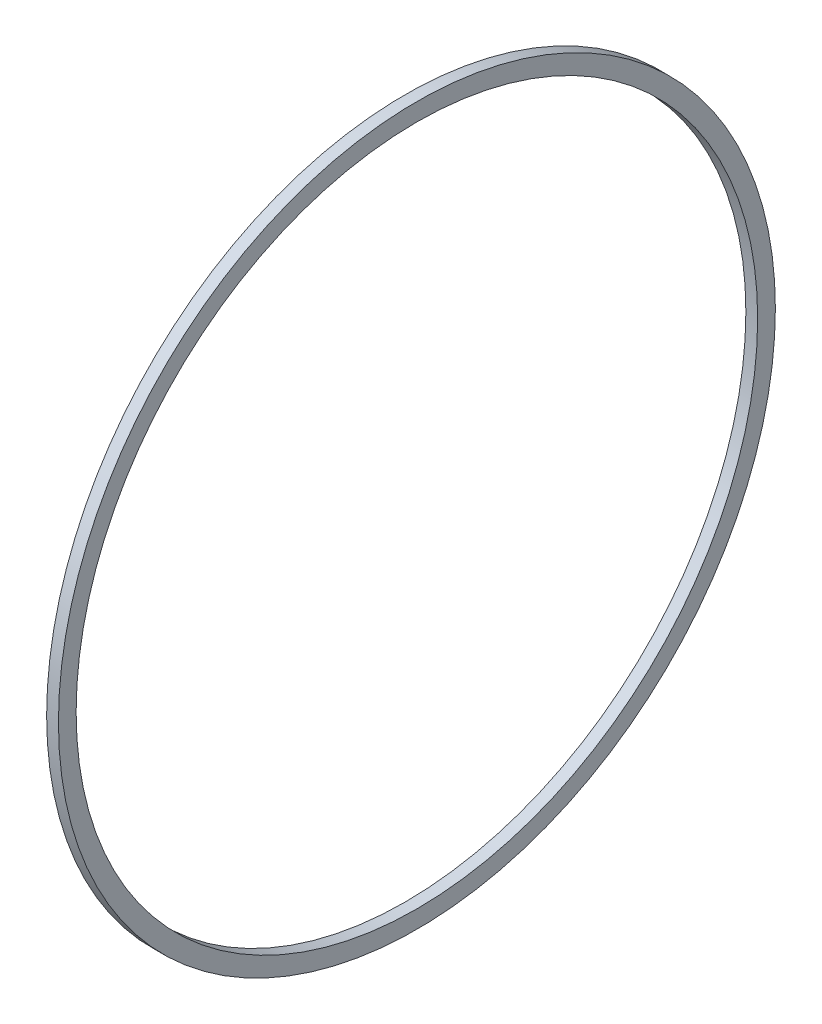
ISO-10303-21;
HEADER;
FILE_DESCRIPTION(('STEP AP214'),'2;1');
FILE_NAME('part.step','',(''),(''),'','','');
FILE_SCHEMA(('AUTOMOTIVE_DESIGN { 1 0 10303 214 1 1 1 1 }'));
ENDSEC;
DATA;
#1=APPLICATION_CONTEXT('core data for automotive mechanical design processes');
#2=APPLICATION_PROTOCOL_DEFINITION('international standard','automotive_design',2000,#1);
#3=PRODUCT_CONTEXT('',#1,'mechanical');
#4=PRODUCT('Part','Part','',(#3));
#5=PRODUCT_RELATED_PRODUCT_CATEGORY('part','',(#4));
#6=PRODUCT_DEFINITION_FORMATION('','',#4);
#7=PRODUCT_DEFINITION_CONTEXT('part definition',#1,'design');
#8=PRODUCT_DEFINITION('design','',#6,#7);
#9=PRODUCT_DEFINITION_SHAPE('','',#8);
#10=(LENGTH_UNIT() NAMED_UNIT(*) SI_UNIT(.MILLI.,.METRE.));
#11=(NAMED_UNIT(*) PLANE_ANGLE_UNIT() SI_UNIT($,.RADIAN.));
#12=(NAMED_UNIT(*) SI_UNIT($,.STERADIAN.) SOLID_ANGLE_UNIT());
#13=UNCERTAINTY_MEASURE_WITH_UNIT(LENGTH_MEASURE(1.E-05),#10,'distance_accuracy_value','');
#14=(GEOMETRIC_REPRESENTATION_CONTEXT(3) GLOBAL_UNCERTAINTY_ASSIGNED_CONTEXT((#13)) GLOBAL_UNIT_ASSIGNED_CONTEXT((#10,
#11,#12)) REPRESENTATION_CONTEXT('',''));
#15=CARTESIAN_POINT('',(0.,0.,0.));
#16=DIRECTION('',(0.,0.,1.));
#17=DIRECTION('',(1.,0.,0.));
#18=AXIS2_PLACEMENT_3D('',#15,#16,#17);
#19=CARTESIAN_POINT('',(2.,0.,0.));
#20=DIRECTION('',(1.,0.,0.));
#21=DIRECTION('',(0.,0.,-1.));
#22=AXIS2_PLACEMENT_3D('',#19,#20,#21);
#23=PLANE('',#22);
#24=CARTESIAN_POINT('',(2.,0.,0.));
#25=DIRECTION('',(1.,0.,0.));
#26=DIRECTION('',(0.,0.,-1.));
#27=AXIS2_PLACEMENT_3D('',#24,#25,#26);
#28=CIRCLE('',#27,60.75);
#29=CARTESIAN_POINT('',(2.,0.,-60.75));
#30=VERTEX_POINT('',#29);
#31=EDGE_CURVE('E12',#30,#30,#28,.T.);
#32=ORIENTED_EDGE('',*,*,#31,.T.);
#33=EDGE_LOOP('',(#32));
#34=FACE_BOUND('',#33,.T.);
#35=CARTESIAN_POINT('',(2.,0.,0.));
#36=DIRECTION('',(1.,0.,0.));
#37=DIRECTION('',(0.,0.,-1.));
#38=AXIS2_PLACEMENT_3D('',#35,#36,#37);
#39=CIRCLE('',#38,57.75);
#40=CARTESIAN_POINT('',(2.,0.,-57.75));
#41=VERTEX_POINT('',#40);
#42=EDGE_CURVE('E60',#41,#41,#39,.T.);
#43=ORIENTED_EDGE('',*,*,#42,.F.);
#44=EDGE_LOOP('',(#43));
#45=FACE_BOUND('',#44,.T.);
#46=ADVANCED_FACE('F47',(#34,#45),#23,.T.);
#47=CARTESIAN_POINT('',(0.,0.,0.));
#48=DIRECTION('',(1.,0.,0.));
#49=DIRECTION('',(0.,0.,-1.));
#50=AXIS2_PLACEMENT_3D('',#47,#48,#49);
#51=PLANE('',#50);
#52=CARTESIAN_POINT('',(0.,0.,0.));
#53=DIRECTION('',(1.,0.,0.));
#54=DIRECTION('',(0.,0.,-1.));
#55=AXIS2_PLACEMENT_3D('',#52,#53,#54);
#56=CIRCLE('',#55,60.75);
#57=CARTESIAN_POINT('',(0.,0.,-60.75));
#58=VERTEX_POINT('',#57);
#59=EDGE_CURVE('E51',#58,#58,#56,.T.);
#60=ORIENTED_EDGE('',*,*,#59,.F.);
#61=EDGE_LOOP('',(#60));
#62=FACE_BOUND('',#61,.T.);
#63=CARTESIAN_POINT('',(0.,0.,0.));
#64=DIRECTION('',(1.,0.,0.));
#65=DIRECTION('',(0.,0.,-1.));
#66=AXIS2_PLACEMENT_3D('',#63,#64,#65);
#67=CIRCLE('',#66,57.75);
#68=CARTESIAN_POINT('',(0.,0.,-57.75));
#69=VERTEX_POINT('',#68);
#70=EDGE_CURVE('E62',#69,#69,#67,.T.);
#71=ORIENTED_EDGE('',*,*,#70,.T.);
#72=EDGE_LOOP('',(#71));
#73=FACE_BOUND('',#72,.T.);
#74=ADVANCED_FACE('F74',(#62,#73),#51,.F.);
#75=CARTESIAN_POINT('',(2.,0.,0.));
#76=DIRECTION('',(-1.,0.,0.));
#77=DIRECTION('',(0.,0.,1.));
#78=AXIS2_PLACEMENT_3D('',#75,#76,#77);
#79=CYLINDRICAL_SURFACE('',#78,60.75);
#80=ORIENTED_EDGE('',*,*,#31,.F.);
#81=EDGE_LOOP('',(#80));
#82=FACE_BOUND('',#81,.T.);
#83=ORIENTED_EDGE('',*,*,#59,.T.);
#84=EDGE_LOOP('',(#83));
#85=FACE_BOUND('',#84,.T.);
#86=ADVANCED_FACE('F49',(#82,#85),#79,.T.);
#87=CARTESIAN_POINT('',(2.,0.,0.));
#88=DIRECTION('',(-1.,0.,0.));
#89=DIRECTION('',(0.,0.,1.));
#90=AXIS2_PLACEMENT_3D('',#87,#88,#89);
#91=CYLINDRICAL_SURFACE('',#90,57.75);
#92=ORIENTED_EDGE('',*,*,#42,.T.);
#93=EDGE_LOOP('',(#92));
#94=FACE_BOUND('',#93,.T.);
#95=ORIENTED_EDGE('',*,*,#70,.F.);
#96=EDGE_LOOP('',(#95));
#97=FACE_BOUND('',#96,.T.);
#98=ADVANCED_FACE('F70',(#94,#97),#91,.F.);
#99=CLOSED_SHELL('',(#46,#74,#86,#98));
#100=MANIFOLD_SOLID_BREP('B2',#99);
#101=ADVANCED_BREP_SHAPE_REPRESENTATION('',(#18,#100),#14);
#102=SHAPE_DEFINITION_REPRESENTATION(#9,#101);
ENDSEC;
END-ISO-10303-21;
